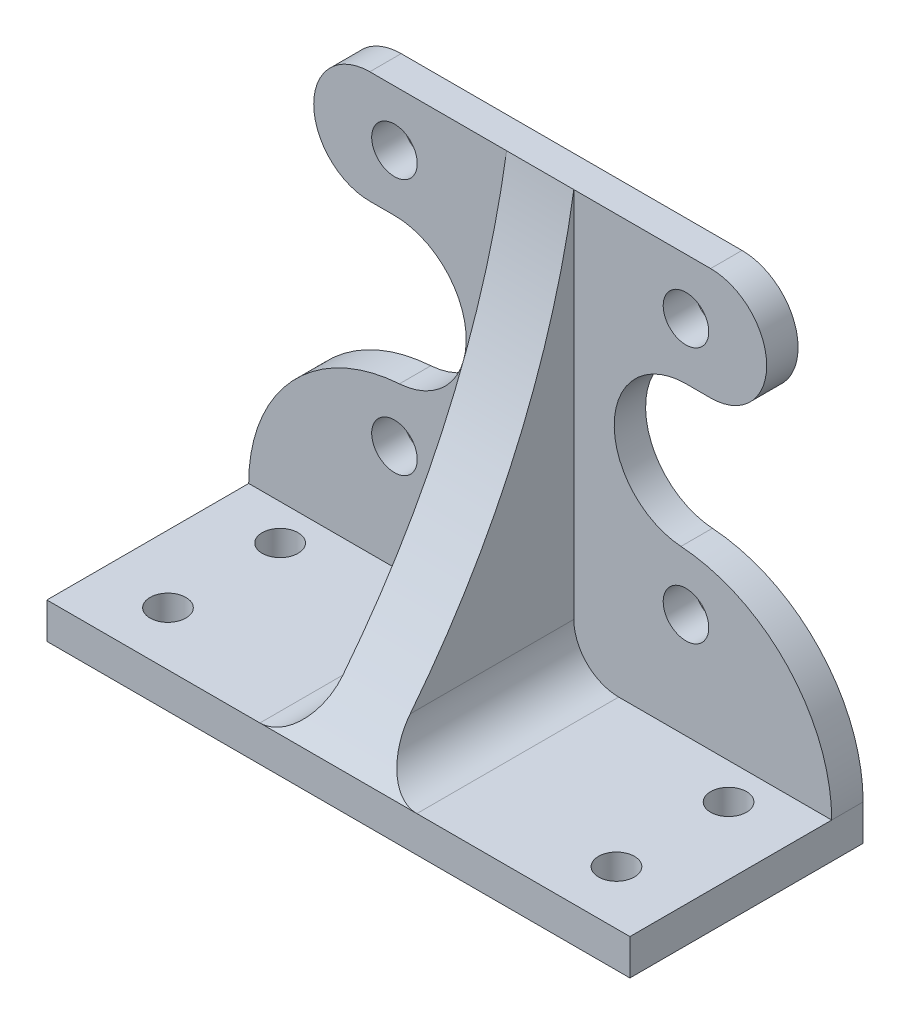
ISO-10303-21;
HEADER;
FILE_DESCRIPTION(('STEP AP214'),'2;1');
FILE_NAME('part.step','',(''),(''),'','','');
FILE_SCHEMA(('AUTOMOTIVE_DESIGN { 1 0 10303 214 1 1 1 1 }'));
ENDSEC;
DATA;
#1=APPLICATION_CONTEXT('core data for automotive mechanical design processes');
#2=APPLICATION_PROTOCOL_DEFINITION('international standard','automotive_design',2000,#1);
#3=PRODUCT_CONTEXT('',#1,'mechanical');
#4=PRODUCT('Part','Part','',(#3));
#5=PRODUCT_RELATED_PRODUCT_CATEGORY('part','',(#4));
#6=PRODUCT_DEFINITION_FORMATION('','',#4);
#7=PRODUCT_DEFINITION_CONTEXT('part definition',#1,'design');
#8=PRODUCT_DEFINITION('design','',#6,#7);
#9=PRODUCT_DEFINITION_SHAPE('','',#8);
#10=(LENGTH_UNIT() NAMED_UNIT(*) SI_UNIT(.MILLI.,.METRE.));
#11=(NAMED_UNIT(*) PLANE_ANGLE_UNIT() SI_UNIT($,.RADIAN.));
#12=(NAMED_UNIT(*) SI_UNIT($,.STERADIAN.) SOLID_ANGLE_UNIT());
#13=UNCERTAINTY_MEASURE_WITH_UNIT(LENGTH_MEASURE(1.E-05),#10,'distance_accuracy_value','');
#14=(GEOMETRIC_REPRESENTATION_CONTEXT(3) GLOBAL_UNCERTAINTY_ASSIGNED_CONTEXT((#13)) GLOBAL_UNIT_ASSIGNED_CONTEXT((#10,
#11,#12)) REPRESENTATION_CONTEXT('',''));
#15=CARTESIAN_POINT('',(0.,0.,0.));
#16=DIRECTION('',(0.,0.,1.));
#17=DIRECTION('',(1.,0.,0.));
#18=AXIS2_PLACEMENT_3D('',#15,#16,#17);
#19=CARTESIAN_POINT('',(7.5,-9.5,26.));
#20=DIRECTION('',(1.,0.,0.));
#21=DIRECTION('',(0.,0.,-1.));
#22=AXIS2_PLACEMENT_3D('',#19,#20,#21);
#23=PLANE('',#22);
#24=CARTESIAN_POINT('',(7.50000000000001,69.6030068356149,184.712880793604));
#25=DIRECTION('',(1.,0.,0.));
#26=DIRECTION('',(0.,0.,-1.));
#27=AXIS2_PLACEMENT_3D('',#24,#25,#26);
#28=CIRCLE('',#27,180.);
#29=CARTESIAN_POINT('',(7.5,41.,7.));
#30=VERTEX_POINT('',#29);
#31=CARTESIAN_POINT('',(7.50000000000001,-42.,43.4869311057027));
#32=VERTEX_POINT('',#31);
#33=EDGE_CURVE('E127',#30,#32,#28,.F.);
#34=ORIENTED_EDGE('',*,*,#33,.T.);
#35=DIRECTION('',(0.,0.,1.));
#36=VECTOR('',#35,1.);
#37=CARTESIAN_POINT('',(7.5,-42.,26.));
#38=LINE('',#37,#36);
#39=CARTESIAN_POINT('',(7.5,-42.,7.));
#40=VERTEX_POINT('',#39);
#41=EDGE_CURVE('E405',#32,#40,#38,.F.);
#42=ORIENTED_EDGE('',*,*,#41,.T.);
#43=DIRECTION('',(0.,1.,0.));
#44=VECTOR('',#43,1.);
#45=CARTESIAN_POINT('',(7.5,0.,7.));
#46=LINE('',#45,#44);
#47=EDGE_CURVE('E133',#40,#30,#46,.T.);
#48=ORIENTED_EDGE('',*,*,#47,.T.);
#49=EDGE_LOOP('',(#34,#42,#48));
#50=FACE_BOUND('',#49,.T.);
#51=ADVANCED_FACE('F48',(#50),#23,.T.);
#52=CARTESIAN_POINT('',(-7.5,-9.5,26.));
#53=DIRECTION('',(1.,0.,0.));
#54=DIRECTION('',(0.,0.,-1.));
#55=AXIS2_PLACEMENT_3D('',#52,#53,#54);
#56=PLANE('',#55);
#57=DIRECTION('',(0.,1.,0.));
#58=VECTOR('',#57,1.);
#59=CARTESIAN_POINT('',(-7.5,0.,7.));
#60=LINE('',#59,#58);
#61=CARTESIAN_POINT('',(-7.5,-42.,7.));
#62=VERTEX_POINT('',#61);
#63=CARTESIAN_POINT('',(-7.5,41.,7.));
#64=VERTEX_POINT('',#63);
#65=EDGE_CURVE('E120',#62,#64,#60,.T.);
#66=ORIENTED_EDGE('',*,*,#65,.F.);
#67=DIRECTION('',(0.,0.,1.));
#68=VECTOR('',#67,1.);
#69=CARTESIAN_POINT('',(-7.5,-42.,52.));
#70=LINE('',#69,#68);
#71=CARTESIAN_POINT('',(-7.5,-42.,43.4869311057027));
#72=VERTEX_POINT('',#71);
#73=EDGE_CURVE('E110',#62,#72,#70,.T.);
#74=ORIENTED_EDGE('',*,*,#73,.T.);
#75=CARTESIAN_POINT('',(-7.5,69.6030068356149,184.712880793604));
#76=DIRECTION('',(1.,0.,0.));
#77=DIRECTION('',(0.,0.,-1.));
#78=AXIS2_PLACEMENT_3D('',#75,#76,#77);
#79=CIRCLE('',#78,180.);
#80=EDGE_CURVE('E117',#64,#72,#79,.F.);
#81=ORIENTED_EDGE('',*,*,#80,.F.);
#82=EDGE_LOOP('',(#66,#74,#81));
#83=FACE_BOUND('',#82,.T.);
#84=ADVANCED_FACE('F115',(#83),#56,.F.);
#85=CARTESIAN_POINT('',(0.,0.,7.));
#86=DIRECTION('',(0.,0.,1.));
#87=DIRECTION('',(1.,0.,0.));
#88=AXIS2_PLACEMENT_3D('',#85,#86,#87);
#89=PLANE('',#88);
#90=CARTESIAN_POINT('',(-32.5,-28.575,7.));
#91=DIRECTION('',(0.,0.,1.));
#92=DIRECTION('',(1.,0.,0.));
#93=AXIS2_PLACEMENT_3D('',#90,#91,#92);
#94=CIRCLE('',#93,5.08);
#95=CARTESIAN_POINT('',(-27.42,-28.575,7.));
#96=VERTEX_POINT('',#95);
#97=EDGE_CURVE('E539',#96,#96,#94,.T.);
#98=ORIENTED_EDGE('',*,*,#97,.F.);
#99=EDGE_LOOP('',(#98));
#100=FACE_BOUND('',#99,.T.);
#101=CARTESIAN_POINT('',(-32.5,28.575,7.));
#102=DIRECTION('',(0.,0.,1.));
#103=DIRECTION('',(1.,0.,0.));
#104=AXIS2_PLACEMENT_3D('',#101,#102,#103);
#105=CIRCLE('',#104,5.08);
#106=CARTESIAN_POINT('',(-27.42,28.575,7.));
#107=VERTEX_POINT('',#106);
#108=EDGE_CURVE('E533',#107,#107,#105,.T.);
#109=ORIENTED_EDGE('',*,*,#108,.F.);
#110=EDGE_LOOP('',(#109));
#111=FACE_BOUND('',#110,.T.);
#112=DIRECTION('',(-1.,0.,0.));
#113=VECTOR('',#112,1.);
#114=CARTESIAN_POINT('',(-65.,-52.,7.));
#115=LINE('',#114,#113);
#116=CARTESIAN_POINT('',(-17.5,-52.,7.));
#117=VERTEX_POINT('',#116);
#118=CARTESIAN_POINT('',(-65.,-52.,7.));
#119=VERTEX_POINT('',#118);
#120=EDGE_CURVE('E239',#117,#119,#115,.T.);
#121=ORIENTED_EDGE('',*,*,#120,.F.);
#122=CARTESIAN_POINT('',(-17.5,-42.,7.));
#123=DIRECTION('',(0.,0.,1.));
#124=DIRECTION('',(1.,0.,0.));
#125=AXIS2_PLACEMENT_3D('',#122,#123,#124);
#126=CIRCLE('',#125,10.);
#127=EDGE_CURVE('E266',#117,#62,#126,.T.);
#128=ORIENTED_EDGE('',*,*,#127,.T.);
#129=ORIENTED_EDGE('',*,*,#65,.T.);
#130=DIRECTION('',(1.,0.,0.));
#131=VECTOR('',#130,1.);
#132=CARTESIAN_POINT('',(0.,41.,7.));
#133=LINE('',#132,#131);
#134=CARTESIAN_POINT('',(-38.,41.,7.));
#135=VERTEX_POINT('',#134);
#136=EDGE_CURVE('E237',#135,#64,#133,.T.);
#137=ORIENTED_EDGE('',*,*,#136,.F.);
#138=CARTESIAN_POINT('',(-38.,28.5,7.));
#139=DIRECTION('',(0.,0.,1.));
#140=DIRECTION('',(1.,0.,0.));
#141=AXIS2_PLACEMENT_3D('',#138,#139,#140);
#142=CIRCLE('',#141,12.5);
#143=CARTESIAN_POINT('',(-38.,16.,7.));
#144=VERTEX_POINT('',#143);
#145=EDGE_CURVE('E216',#144,#135,#142,.F.);
#146=ORIENTED_EDGE('',*,*,#145,.F.);
#147=DIRECTION('',(-1.,0.,0.));
#148=VECTOR('',#147,1.);
#149=CARTESIAN_POINT('',(0.,16.,7.));
#150=LINE('',#149,#148);
#151=CARTESIAN_POINT('',(-32.5,16.,7.));
#152=VERTEX_POINT('',#151);
#153=EDGE_CURVE('E221',#152,#144,#150,.T.);
#154=ORIENTED_EDGE('',*,*,#153,.F.);
#155=CARTESIAN_POINT('',(-32.5,0.,7.));
#156=DIRECTION('',(0.,0.,1.));
#157=DIRECTION('',(1.,0.,0.));
#158=AXIS2_PLACEMENT_3D('',#155,#156,#157);
#159=CIRCLE('',#158,16.);
#160=CARTESIAN_POINT('',(-31.3869221260816,-15.9612360939431,7.));
#161=VERTEX_POINT('',#160);
#162=EDGE_CURVE('E224',#161,#152,#159,.T.);
#163=ORIENTED_EDGE('',*,*,#162,.F.);
#164=CARTESIAN_POINT('',(-28.8737113402062,-52.,7.));
#165=DIRECTION('',(0.,0.,1.));
#166=DIRECTION('',(1.,0.,0.));
#167=AXIS2_PLACEMENT_3D('',#164,#165,#166);
#168=CIRCLE('',#167,36.1262886597938);
#169=EDGE_CURVE('E191',#119,#161,#168,.F.);
#170=ORIENTED_EDGE('',*,*,#169,.F.);
#171=EDGE_LOOP('',(#121,#128,#129,#137,#146,#154,#163,#170));
#172=FACE_BOUND('',#171,.T.);
#173=ADVANCED_FACE('F283',(#100,#111,#172),#89,.T.);
#174=CARTESIAN_POINT('',(-65.,-52.,52.));
#175=DIRECTION('',(0.,-1.,0.));
#176=DIRECTION('',(0.,0.,-1.));
#177=AXIS2_PLACEMENT_3D('',#174,#175,#176);
#178=PLANE('',#177);
#179=CARTESIAN_POINT('',(-50.,-52.,15.));
#180=DIRECTION('',(0.,1.,0.));
#181=DIRECTION('',(-1.,0.,0.));
#182=AXIS2_PLACEMENT_3D('',#179,#180,#181);
#183=CIRCLE('',#182,4.00000000000001);
#184=CARTESIAN_POINT('',(-54.,-52.,15.));
#185=VERTEX_POINT('',#184);
#186=EDGE_CURVE('E152',#185,#185,#183,.T.);
#187=ORIENTED_EDGE('',*,*,#186,.F.);
#188=EDGE_LOOP('',(#187));
#189=FACE_BOUND('',#188,.T.);
#190=CARTESIAN_POINT('',(-50.,-52.,40.));
#191=DIRECTION('',(0.,1.,0.));
#192=DIRECTION('',(-1.,0.,0.));
#193=AXIS2_PLACEMENT_3D('',#190,#191,#192);
#194=CIRCLE('',#193,4.00000000000001);
#195=CARTESIAN_POINT('',(-54.,-52.,40.));
#196=VERTEX_POINT('',#195);
#197=EDGE_CURVE('E146',#196,#196,#194,.T.);
#198=ORIENTED_EDGE('',*,*,#197,.F.);
#199=EDGE_LOOP('',(#198));
#200=FACE_BOUND('',#199,.T.);
#201=DIRECTION('',(-1.,0.,0.));
#202=VECTOR('',#201,1.);
#203=CARTESIAN_POINT('',(-65.,-52.,52.));
#204=LINE('',#203,#202);
#205=CARTESIAN_POINT('',(-17.5,-52.,52.));
#206=VERTEX_POINT('',#205);
#207=CARTESIAN_POINT('',(-65.,-52.,52.));
#208=VERTEX_POINT('',#207);
#209=EDGE_CURVE('E250',#206,#208,#204,.T.);
#210=ORIENTED_EDGE('',*,*,#209,.F.);
#211=DIRECTION('',(0.,0.,1.));
#212=VECTOR('',#211,1.);
#213=CARTESIAN_POINT('',(-17.5,-52.,7.));
#214=LINE('',#213,#212);
#215=EDGE_CURVE('E76',#206,#117,#214,.F.);
#216=ORIENTED_EDGE('',*,*,#215,.T.);
#217=ORIENTED_EDGE('',*,*,#120,.T.);
#218=DIRECTION('',(0.,0.,-1.));
#219=VECTOR('',#218,1.);
#220=CARTESIAN_POINT('',(-65.,-52.,52.));
#221=LINE('',#220,#219);
#222=EDGE_CURVE('E253',#208,#119,#221,.T.);
#223=ORIENTED_EDGE('',*,*,#222,.F.);
#224=EDGE_LOOP('',(#210,#216,#217,#223));
#225=FACE_BOUND('',#224,.T.);
#226=ADVANCED_FACE('F343',(#189,#200,#225),#178,.F.);
#227=CARTESIAN_POINT('',(65.,60.,7.));
#228=DIRECTION('',(-1.,0.,0.));
#229=DIRECTION('',(0.,-1.,0.));
#230=AXIS2_PLACEMENT_3D('',#227,#228,#229);
#231=PLANE('',#230);
#232=DIRECTION('',(0.,0.,-1.));
#233=VECTOR('',#232,1.);
#234=CARTESIAN_POINT('',(65.,-52.,10.));
#235=LINE('',#234,#233);
#236=CARTESIAN_POINT('',(65.,-52.,7.));
#237=VERTEX_POINT('',#236);
#238=CARTESIAN_POINT('',(65.,-52.,0.));
#239=VERTEX_POINT('',#238);
#240=EDGE_CURVE('E201',#237,#239,#235,.T.);
#241=ORIENTED_EDGE('',*,*,#240,.F.);
#242=DIRECTION('',(0.,0.,-1.));
#243=VECTOR('',#242,1.);
#244=CARTESIAN_POINT('',(65.,-52.,52.));
#245=LINE('',#244,#243);
#246=CARTESIAN_POINT('',(65.,-52.,52.));
#247=VERTEX_POINT('',#246);
#248=EDGE_CURVE('E387',#247,#237,#245,.T.);
#249=ORIENTED_EDGE('',*,*,#248,.F.);
#250=DIRECTION('',(0.,1.,0.));
#251=VECTOR('',#250,1.);
#252=CARTESIAN_POINT('',(65.,-60.,52.));
#253=LINE('',#252,#251);
#254=CARTESIAN_POINT('',(65.,-60.,52.));
#255=VERTEX_POINT('',#254);
#256=EDGE_CURVE('E247',#255,#247,#253,.T.);
#257=ORIENTED_EDGE('',*,*,#256,.F.);
#258=DIRECTION('',(0.,0.,-1.));
#259=VECTOR('',#258,1.);
#260=CARTESIAN_POINT('',(65.,-60.,7.));
#261=LINE('',#260,#259);
#262=CARTESIAN_POINT('',(65.,-60.,0.));
#263=VERTEX_POINT('',#262);
#264=EDGE_CURVE('E410',#255,#263,#261,.T.);
#265=ORIENTED_EDGE('',*,*,#264,.T.);
#266=DIRECTION('',(0.,1.,0.));
#267=VECTOR('',#266,1.);
#268=CARTESIAN_POINT('',(65.,60.,0.));
#269=LINE('',#268,#267);
#270=EDGE_CURVE('E392',#263,#239,#269,.T.);
#271=ORIENTED_EDGE('',*,*,#270,.T.);
#272=EDGE_LOOP('',(#241,#249,#257,#265,#271));
#273=FACE_BOUND('',#272,.T.);
#274=ADVANCED_FACE('F372',(#273),#231,.F.);
#275=CARTESIAN_POINT('',(-65.,60.,7.));
#276=DIRECTION('',(1.,0.,0.));
#277=DIRECTION('',(0.,1.,0.));
#278=AXIS2_PLACEMENT_3D('',#275,#276,#277);
#279=PLANE('',#278);
#280=DIRECTION('',(0.,0.,-1.));
#281=VECTOR('',#280,1.);
#282=CARTESIAN_POINT('',(-65.,-52.,10.));
#283=LINE('',#282,#281);
#284=CARTESIAN_POINT('',(-65.,-52.,0.));
#285=VERTEX_POINT('',#284);
#286=EDGE_CURVE('E210',#119,#285,#283,.T.);
#287=ORIENTED_EDGE('',*,*,#286,.T.);
#288=DIRECTION('',(0.,-1.,0.));
#289=VECTOR('',#288,1.);
#290=CARTESIAN_POINT('',(-65.,60.,0.));
#291=LINE('',#290,#289);
#292=CARTESIAN_POINT('',(-65.,-60.,0.));
#293=VERTEX_POINT('',#292);
#294=EDGE_CURVE('E456',#285,#293,#291,.T.);
#295=ORIENTED_EDGE('',*,*,#294,.T.);
#296=DIRECTION('',(0.,0.,-1.));
#297=VECTOR('',#296,1.);
#298=CARTESIAN_POINT('',(-65.,-60.,7.));
#299=LINE('',#298,#297);
#300=CARTESIAN_POINT('',(-65.,-60.,52.));
#301=VERTEX_POINT('',#300);
#302=EDGE_CURVE('E406',#301,#293,#299,.T.);
#303=ORIENTED_EDGE('',*,*,#302,.F.);
#304=DIRECTION('',(0.,-1.,0.));
#305=VECTOR('',#304,1.);
#306=CARTESIAN_POINT('',(-65.,-60.,52.));
#307=LINE('',#306,#305);
#308=EDGE_CURVE('E240',#208,#301,#307,.T.);
#309=ORIENTED_EDGE('',*,*,#308,.F.);
#310=ORIENTED_EDGE('',*,*,#222,.T.);
#311=EDGE_LOOP('',(#287,#295,#303,#309,#310));
#312=FACE_BOUND('',#311,.T.);
#313=ADVANCED_FACE('F364',(#312),#279,.F.);
#314=ORIENTED_EDGE('',*,*,#47,.F.);
#315=CARTESIAN_POINT('',(17.5,-42.,7.));
#316=DIRECTION('',(0.,0.,1.));
#317=DIRECTION('',(1.,0.,0.));
#318=AXIS2_PLACEMENT_3D('',#315,#316,#317);
#319=CIRCLE('',#318,10.);
#320=CARTESIAN_POINT('',(17.5,-52.,7.));
#321=VERTEX_POINT('',#320);
#322=EDGE_CURVE('E98',#40,#321,#319,.T.);
#323=ORIENTED_EDGE('',*,*,#322,.T.);
#324=EDGE_CURVE('E244',#237,#321,#115,.T.);
#325=ORIENTED_EDGE('',*,*,#324,.F.);
#326=CARTESIAN_POINT('',(28.8737113402062,-52.,7.));
#327=DIRECTION('',(0.,0.,1.));
#328=DIRECTION('',(1.,0.,0.));
#329=AXIS2_PLACEMENT_3D('',#326,#327,#328);
#330=CIRCLE('',#329,36.1262886597938);
#331=CARTESIAN_POINT('',(31.3869221260816,-15.9612360939431,7.));
#332=VERTEX_POINT('',#331);
#333=EDGE_CURVE('E213',#237,#332,#330,.T.);
#334=ORIENTED_EDGE('',*,*,#333,.T.);
#335=CARTESIAN_POINT('',(32.5,0.,7.));
#336=DIRECTION('',(0.,0.,1.));
#337=DIRECTION('',(1.,0.,0.));
#338=AXIS2_PLACEMENT_3D('',#335,#336,#337);
#339=CIRCLE('',#338,16.);
#340=CARTESIAN_POINT('',(32.5,16.,7.));
#341=VERTEX_POINT('',#340);
#342=EDGE_CURVE('E227',#332,#341,#339,.F.);
#343=ORIENTED_EDGE('',*,*,#342,.T.);
#344=DIRECTION('',(1.,0.,0.));
#345=VECTOR('',#344,1.);
#346=CARTESIAN_POINT('',(0.,16.,7.));
#347=LINE('',#346,#345);
#348=CARTESIAN_POINT('',(38.,16.,7.));
#349=VERTEX_POINT('',#348);
#350=EDGE_CURVE('E230',#341,#349,#347,.T.);
#351=ORIENTED_EDGE('',*,*,#350,.T.);
#352=CARTESIAN_POINT('',(38.,28.5,7.));
#353=DIRECTION('',(0.,0.,1.));
#354=DIRECTION('',(1.,0.,0.));
#355=AXIS2_PLACEMENT_3D('',#352,#353,#354);
#356=CIRCLE('',#355,12.5);
#357=CARTESIAN_POINT('',(38.,41.,7.));
#358=VERTEX_POINT('',#357);
#359=EDGE_CURVE('E233',#349,#358,#356,.T.);
#360=ORIENTED_EDGE('',*,*,#359,.T.);
#361=EDGE_CURVE('E236',#30,#358,#133,.T.);
#362=ORIENTED_EDGE('',*,*,#361,.F.);
#363=EDGE_LOOP('',(#314,#323,#325,#334,#343,#351,#360,#362));
#364=FACE_BOUND('',#363,.T.);
#365=CARTESIAN_POINT('',(32.5,-28.575,7.));
#366=DIRECTION('',(0.,0.,1.));
#367=DIRECTION('',(-1.,0.,0.));
#368=AXIS2_PLACEMENT_3D('',#365,#366,#367);
#369=CIRCLE('',#368,5.08000000000001);
#370=CARTESIAN_POINT('',(27.42,-28.575,7.));
#371=VERTEX_POINT('',#370);
#372=EDGE_CURVE('E545',#371,#371,#369,.T.);
#373=ORIENTED_EDGE('',*,*,#372,.F.);
#374=EDGE_LOOP('',(#373));
#375=FACE_BOUND('',#374,.T.);
#376=CARTESIAN_POINT('',(32.5,28.575,7.));
#377=DIRECTION('',(0.,0.,1.));
#378=DIRECTION('',(-1.,0.,0.));
#379=AXIS2_PLACEMENT_3D('',#376,#377,#378);
#380=CIRCLE('',#379,5.08000000000001);
#381=CARTESIAN_POINT('',(27.42,28.575,7.));
#382=VERTEX_POINT('',#381);
#383=EDGE_CURVE('E415',#382,#382,#380,.T.);
#384=ORIENTED_EDGE('',*,*,#383,.F.);
#385=EDGE_LOOP('',(#384));
#386=FACE_BOUND('',#385,.T.);
#387=ADVANCED_FACE('F360',(#364,#375,#386),#89,.T.);
#388=CARTESIAN_POINT('',(0.,0.,0.));
#389=DIRECTION('',(0.,0.,1.));
#390=DIRECTION('',(1.,0.,0.));
#391=AXIS2_PLACEMENT_3D('',#388,#389,#390);
#392=PLANE('',#391);
#393=CARTESIAN_POINT('',(32.5,-28.575,0.));
#394=DIRECTION('',(0.,0.,1.));
#395=DIRECTION('',(-1.,0.,0.));
#396=AXIS2_PLACEMENT_3D('',#393,#394,#395);
#397=CIRCLE('',#396,5.08000000000001);
#398=CARTESIAN_POINT('',(27.42,-28.575,0.));
#399=VERTEX_POINT('',#398);
#400=EDGE_CURVE('E542',#399,#399,#397,.T.);
#401=ORIENTED_EDGE('',*,*,#400,.T.);
#402=EDGE_LOOP('',(#401));
#403=FACE_BOUND('',#402,.T.);
#404=CARTESIAN_POINT('',(32.5,28.575,0.));
#405=DIRECTION('',(0.,0.,1.));
#406=DIRECTION('',(-1.,0.,0.));
#407=AXIS2_PLACEMENT_3D('',#404,#405,#406);
#408=CIRCLE('',#407,5.08000000000001);
#409=CARTESIAN_POINT('',(27.42,28.575,0.));
#410=VERTEX_POINT('',#409);
#411=EDGE_CURVE('E256',#410,#410,#408,.T.);
#412=ORIENTED_EDGE('',*,*,#411,.T.);
#413=EDGE_LOOP('',(#412));
#414=FACE_BOUND('',#413,.T.);
#415=ORIENTED_EDGE('',*,*,#270,.F.);
#416=DIRECTION('',(1.,0.,0.));
#417=VECTOR('',#416,1.);
#418=CARTESIAN_POINT('',(-65.,-60.,0.));
#419=LINE('',#418,#417);
#420=EDGE_CURVE('E459',#293,#263,#419,.T.);
#421=ORIENTED_EDGE('',*,*,#420,.F.);
#422=ORIENTED_EDGE('',*,*,#294,.F.);
#423=CARTESIAN_POINT('',(-28.8737113402062,-52.,0.));
#424=DIRECTION('',(0.,0.,-1.));
#425=DIRECTION('',(-1.,0.,0.));
#426=AXIS2_PLACEMENT_3D('',#423,#424,#425);
#427=CIRCLE('',#426,36.1262886597938);
#428=CARTESIAN_POINT('',(-31.3869221260816,-15.9612360939431,0.));
#429=VERTEX_POINT('',#428);
#430=EDGE_CURVE('E172',#429,#285,#427,.F.);
#431=ORIENTED_EDGE('',*,*,#430,.F.);
#432=CARTESIAN_POINT('',(-32.5,0.,0.));
#433=DIRECTION('',(0.,0.,-1.));
#434=DIRECTION('',(-1.,0.,0.));
#435=AXIS2_PLACEMENT_3D('',#432,#433,#434);
#436=CIRCLE('',#435,16.);
#437=CARTESIAN_POINT('',(-32.5,16.,0.));
#438=VERTEX_POINT('',#437);
#439=EDGE_CURVE('E169',#438,#429,#436,.T.);
#440=ORIENTED_EDGE('',*,*,#439,.F.);
#441=DIRECTION('',(1.,0.,0.));
#442=VECTOR('',#441,1.);
#443=CARTESIAN_POINT('',(0.,16.,0.));
#444=LINE('',#443,#442);
#445=CARTESIAN_POINT('',(-38.,16.,0.));
#446=VERTEX_POINT('',#445);
#447=EDGE_CURVE('E166',#446,#438,#444,.T.);
#448=ORIENTED_EDGE('',*,*,#447,.F.);
#449=CARTESIAN_POINT('',(-38.,28.5,0.));
#450=DIRECTION('',(0.,0.,-1.));
#451=DIRECTION('',(-1.,0.,0.));
#452=AXIS2_PLACEMENT_3D('',#449,#450,#451);
#453=CIRCLE('',#452,12.5);
#454=CARTESIAN_POINT('',(-38.,41.,0.));
#455=VERTEX_POINT('',#454);
#456=EDGE_CURVE('E163',#455,#446,#453,.F.);
#457=ORIENTED_EDGE('',*,*,#456,.F.);
#458=DIRECTION('',(-1.,0.,0.));
#459=VECTOR('',#458,1.);
#460=CARTESIAN_POINT('',(0.,41.,0.));
#461=LINE('',#460,#459);
#462=CARTESIAN_POINT('',(38.,41.,0.));
#463=VERTEX_POINT('',#462);
#464=EDGE_CURVE('E158',#463,#455,#461,.T.);
#465=ORIENTED_EDGE('',*,*,#464,.F.);
#466=CARTESIAN_POINT('',(38.,28.5,0.));
#467=DIRECTION('',(0.,0.,-1.));
#468=DIRECTION('',(-1.,0.,0.));
#469=AXIS2_PLACEMENT_3D('',#466,#467,#468);
#470=CIRCLE('',#469,12.5);
#471=CARTESIAN_POINT('',(38.,16.,0.));
#472=VERTEX_POINT('',#471);
#473=EDGE_CURVE('E184',#463,#472,#470,.T.);
#474=ORIENTED_EDGE('',*,*,#473,.T.);
#475=DIRECTION('',(-1.,0.,0.));
#476=VECTOR('',#475,1.);
#477=CARTESIAN_POINT('',(0.,16.,0.));
#478=LINE('',#477,#476);
#479=CARTESIAN_POINT('',(32.5,16.,0.));
#480=VERTEX_POINT('',#479);
#481=EDGE_CURVE('E181',#472,#480,#478,.T.);
#482=ORIENTED_EDGE('',*,*,#481,.T.);
#483=CARTESIAN_POINT('',(32.5,0.,0.));
#484=DIRECTION('',(0.,0.,-1.));
#485=DIRECTION('',(-1.,0.,0.));
#486=AXIS2_PLACEMENT_3D('',#483,#484,#485);
#487=CIRCLE('',#486,16.);
#488=CARTESIAN_POINT('',(31.3869221260816,-15.9612360939431,0.));
#489=VERTEX_POINT('',#488);
#490=EDGE_CURVE('E178',#480,#489,#487,.F.);
#491=ORIENTED_EDGE('',*,*,#490,.T.);
#492=CARTESIAN_POINT('',(28.8737113402062,-52.,0.));
#493=DIRECTION('',(0.,0.,-1.));
#494=DIRECTION('',(-1.,0.,0.));
#495=AXIS2_PLACEMENT_3D('',#492,#493,#494);
#496=CIRCLE('',#495,36.1262886597938);
#497=EDGE_CURVE('E175',#489,#239,#496,.T.);
#498=ORIENTED_EDGE('',*,*,#497,.T.);
#499=EDGE_LOOP('',(#415,#421,#422,#431,#440,#448,#457,#465,#474,#482,#491,#498));
#500=FACE_BOUND('',#499,.T.);
#501=CARTESIAN_POINT('',(-32.5,-28.575,0.));
#502=DIRECTION('',(0.,0.,1.));
#503=DIRECTION('',(1.,0.,0.));
#504=AXIS2_PLACEMENT_3D('',#501,#502,#503);
#505=CIRCLE('',#504,5.08);
#506=CARTESIAN_POINT('',(-27.42,-28.575,0.));
#507=VERTEX_POINT('',#506);
#508=EDGE_CURVE('E536',#507,#507,#505,.T.);
#509=ORIENTED_EDGE('',*,*,#508,.T.);
#510=EDGE_LOOP('',(#509));
#511=FACE_BOUND('',#510,.T.);
#512=CARTESIAN_POINT('',(-32.5,28.575,0.));
#513=DIRECTION('',(0.,0.,1.));
#514=DIRECTION('',(1.,0.,0.));
#515=AXIS2_PLACEMENT_3D('',#512,#513,#514);
#516=CIRCLE('',#515,5.08);
#517=CARTESIAN_POINT('',(-27.42,28.575,0.));
#518=VERTEX_POINT('',#517);
#519=EDGE_CURVE('E463',#518,#518,#516,.T.);
#520=ORIENTED_EDGE('',*,*,#519,.T.);
#521=EDGE_LOOP('',(#520));
#522=FACE_BOUND('',#521,.T.);
#523=ADVANCED_FACE('F363',(#403,#414,#500,#511,#522),#392,.F.);
#524=CARTESIAN_POINT('',(-65.,-60.,7.));
#525=DIRECTION('',(0.,1.,0.));
#526=DIRECTION('',(0.,0.,1.));
#527=AXIS2_PLACEMENT_3D('',#524,#525,#526);
#528=PLANE('',#527);
#529=CARTESIAN_POINT('',(50.,-60.,15.));
#530=DIRECTION('',(0.,1.,0.));
#531=DIRECTION('',(1.,0.,0.));
#532=AXIS2_PLACEMENT_3D('',#529,#530,#531);
#533=CIRCLE('',#532,4.00000000000001);
#534=CARTESIAN_POINT('',(54.,-60.,15.));
#535=VERTEX_POINT('',#534);
#536=EDGE_CURVE('E137',#535,#535,#533,.T.);
#537=ORIENTED_EDGE('',*,*,#536,.T.);
#538=EDGE_LOOP('',(#537));
#539=FACE_BOUND('',#538,.T.);
#540=CARTESIAN_POINT('',(50.,-60.,40.));
#541=DIRECTION('',(0.,1.,0.));
#542=DIRECTION('',(1.,0.,0.));
#543=AXIS2_PLACEMENT_3D('',#540,#541,#542);
#544=CIRCLE('',#543,4.00000000000001);
#545=CARTESIAN_POINT('',(54.,-60.,40.));
#546=VERTEX_POINT('',#545);
#547=EDGE_CURVE('E143',#546,#546,#544,.T.);
#548=ORIENTED_EDGE('',*,*,#547,.T.);
#549=EDGE_LOOP('',(#548));
#550=FACE_BOUND('',#549,.T.);
#551=ORIENTED_EDGE('',*,*,#264,.F.);
#552=DIRECTION('',(1.,0.,0.));
#553=VECTOR('',#552,1.);
#554=CARTESIAN_POINT('',(-65.,-60.,52.));
#555=LINE('',#554,#553);
#556=EDGE_CURVE('E243',#301,#255,#555,.T.);
#557=ORIENTED_EDGE('',*,*,#556,.F.);
#558=ORIENTED_EDGE('',*,*,#302,.T.);
#559=ORIENTED_EDGE('',*,*,#420,.T.);
#560=EDGE_LOOP('',(#551,#557,#558,#559));
#561=FACE_BOUND('',#560,.T.);
#562=CARTESIAN_POINT('',(-50.,-60.,15.));
#563=DIRECTION('',(0.,1.,0.));
#564=DIRECTION('',(-1.,0.,0.));
#565=AXIS2_PLACEMENT_3D('',#562,#563,#564);
#566=CIRCLE('',#565,4.00000000000001);
#567=CARTESIAN_POINT('',(-54.,-60.,15.));
#568=VERTEX_POINT('',#567);
#569=EDGE_CURVE('E155',#568,#568,#566,.T.);
#570=ORIENTED_EDGE('',*,*,#569,.T.);
#571=EDGE_LOOP('',(#570));
#572=FACE_BOUND('',#571,.T.);
#573=CARTESIAN_POINT('',(-50.,-60.,40.));
#574=DIRECTION('',(0.,1.,0.));
#575=DIRECTION('',(-1.,0.,0.));
#576=AXIS2_PLACEMENT_3D('',#573,#574,#575);
#577=CIRCLE('',#576,4.00000000000001);
#578=CARTESIAN_POINT('',(-54.,-60.,40.));
#579=VERTEX_POINT('',#578);
#580=EDGE_CURVE('E149',#579,#579,#577,.T.);
#581=ORIENTED_EDGE('',*,*,#580,.T.);
#582=EDGE_LOOP('',(#581));
#583=FACE_BOUND('',#582,.T.);
#584=ADVANCED_FACE('F358',(#539,#550,#561,#572,#583),#528,.F.);
#585=CARTESIAN_POINT('',(-32.5,28.575,0.));
#586=DIRECTION('',(0.,0.,1.));
#587=DIRECTION('',(1.,0.,0.));
#588=AXIS2_PLACEMENT_3D('',#585,#586,#587);
#589=CYLINDRICAL_SURFACE('',#588,5.08);
#590=ORIENTED_EDGE('',*,*,#519,.F.);
#591=EDGE_LOOP('',(#590));
#592=FACE_BOUND('',#591,.T.);
#593=ORIENTED_EDGE('',*,*,#108,.T.);
#594=EDGE_LOOP('',(#593));
#595=FACE_BOUND('',#594,.T.);
#596=ADVANCED_FACE('F354',(#592,#595),#589,.F.);
#597=CARTESIAN_POINT('',(-32.5,-28.575,0.));
#598=DIRECTION('',(0.,0.,1.));
#599=DIRECTION('',(1.,0.,0.));
#600=AXIS2_PLACEMENT_3D('',#597,#598,#599);
#601=CYLINDRICAL_SURFACE('',#600,5.08);
#602=ORIENTED_EDGE('',*,*,#508,.F.);
#603=EDGE_LOOP('',(#602));
#604=FACE_BOUND('',#603,.T.);
#605=ORIENTED_EDGE('',*,*,#97,.T.);
#606=EDGE_LOOP('',(#605));
#607=FACE_BOUND('',#606,.T.);
#608=ADVANCED_FACE('F350',(#604,#607),#601,.F.);
#609=CARTESIAN_POINT('',(32.5,-28.575,0.));
#610=DIRECTION('',(0.,0.,1.));
#611=DIRECTION('',(1.,0.,0.));
#612=AXIS2_PLACEMENT_3D('',#609,#610,#611);
#613=CYLINDRICAL_SURFACE('',#612,5.08000000000001);
#614=ORIENTED_EDGE('',*,*,#400,.F.);
#615=EDGE_LOOP('',(#614));
#616=FACE_BOUND('',#615,.T.);
#617=ORIENTED_EDGE('',*,*,#372,.T.);
#618=EDGE_LOOP('',(#617));
#619=FACE_BOUND('',#618,.T.);
#620=ADVANCED_FACE('F346',(#616,#619),#613,.F.);
#621=CARTESIAN_POINT('',(32.5,28.575,0.));
#622=DIRECTION('',(0.,0.,1.));
#623=DIRECTION('',(1.,0.,0.));
#624=AXIS2_PLACEMENT_3D('',#621,#622,#623);
#625=CYLINDRICAL_SURFACE('',#624,5.08000000000001);
#626=ORIENTED_EDGE('',*,*,#411,.F.);
#627=EDGE_LOOP('',(#626));
#628=FACE_BOUND('',#627,.T.);
#629=ORIENTED_EDGE('',*,*,#383,.T.);
#630=EDGE_LOOP('',(#629));
#631=FACE_BOUND('',#630,.T.);
#632=ADVANCED_FACE('F341',(#628,#631),#625,.F.);
#633=CARTESIAN_POINT('',(50.,-52.,15.));
#634=DIRECTION('',(0.,1.,0.));
#635=DIRECTION('',(1.,0.,0.));
#636=AXIS2_PLACEMENT_3D('',#633,#634,#635);
#637=CIRCLE('',#636,4.00000000000001);
#638=CARTESIAN_POINT('',(54.,-52.,15.));
#639=VERTEX_POINT('',#638);
#640=EDGE_CURVE('E136',#639,#639,#637,.T.);
#641=ORIENTED_EDGE('',*,*,#640,.F.);
#642=EDGE_LOOP('',(#641));
#643=FACE_BOUND('',#642,.T.);
#644=CARTESIAN_POINT('',(50.,-52.,40.));
#645=DIRECTION('',(0.,1.,0.));
#646=DIRECTION('',(1.,0.,0.));
#647=AXIS2_PLACEMENT_3D('',#644,#645,#646);
#648=CIRCLE('',#647,4.00000000000001);
#649=CARTESIAN_POINT('',(54.,-52.,40.));
#650=VERTEX_POINT('',#649);
#651=EDGE_CURVE('E140',#650,#650,#648,.T.);
#652=ORIENTED_EDGE('',*,*,#651,.F.);
#653=EDGE_LOOP('',(#652));
#654=FACE_BOUND('',#653,.T.);
#655=ORIENTED_EDGE('',*,*,#324,.T.);
#656=DIRECTION('',(0.,0.,1.));
#657=VECTOR('',#656,1.);
#658=CARTESIAN_POINT('',(17.5,-52.,52.));
#659=LINE('',#658,#657);
#660=CARTESIAN_POINT('',(17.5,-52.,52.));
#661=VERTEX_POINT('',#660);
#662=EDGE_CURVE('E402',#321,#661,#659,.T.);
#663=ORIENTED_EDGE('',*,*,#662,.T.);
#664=EDGE_CURVE('E251',#247,#661,#204,.T.);
#665=ORIENTED_EDGE('',*,*,#664,.F.);
#666=ORIENTED_EDGE('',*,*,#248,.T.);
#667=EDGE_LOOP('',(#655,#663,#665,#666));
#668=FACE_BOUND('',#667,.T.);
#669=ADVANCED_FACE('F338',(#643,#654,#668),#178,.F.);
#670=CARTESIAN_POINT('',(0.,0.,52.));
#671=DIRECTION('',(0.,0.,-1.));
#672=DIRECTION('',(-1.,0.,0.));
#673=AXIS2_PLACEMENT_3D('',#670,#671,#672);
#674=PLANE('',#673);
#675=ORIENTED_EDGE('',*,*,#664,.T.);
#676=DIRECTION('',(1.,0.,0.));
#677=VECTOR('',#676,1.);
#678=CARTESIAN_POINT('',(0.,-52.,52.));
#679=LINE('',#678,#677);
#680=EDGE_CURVE('E68',#206,#661,#679,.T.);
#681=ORIENTED_EDGE('',*,*,#680,.F.);
#682=ORIENTED_EDGE('',*,*,#209,.T.);
#683=ORIENTED_EDGE('',*,*,#308,.T.);
#684=ORIENTED_EDGE('',*,*,#556,.T.);
#685=ORIENTED_EDGE('',*,*,#256,.T.);
#686=EDGE_LOOP('',(#675,#681,#682,#683,#684,#685));
#687=FACE_BOUND('',#686,.T.);
#688=ADVANCED_FACE('F334',(#687),#674,.F.);
#689=CARTESIAN_POINT('',(0.,41.,10.));
#690=DIRECTION('',(0.,-1.,0.));
#691=DIRECTION('',(0.,0.,-1.));
#692=AXIS2_PLACEMENT_3D('',#689,#690,#691);
#693=PLANE('',#692);
#694=ORIENTED_EDGE('',*,*,#464,.T.);
#695=DIRECTION('',(0.,0.,-1.));
#696=VECTOR('',#695,1.);
#697=CARTESIAN_POINT('',(-38.,41.,10.));
#698=LINE('',#697,#696);
#699=EDGE_CURVE('E187',#135,#455,#698,.T.);
#700=ORIENTED_EDGE('',*,*,#699,.F.);
#701=ORIENTED_EDGE('',*,*,#136,.T.);
#702=EDGE_CURVE('E126',#64,#30,#133,.T.);
#703=ORIENTED_EDGE('',*,*,#702,.T.);
#704=ORIENTED_EDGE('',*,*,#361,.T.);
#705=DIRECTION('',(0.,0.,-1.));
#706=VECTOR('',#705,1.);
#707=CARTESIAN_POINT('',(38.,41.,10.));
#708=LINE('',#707,#706);
#709=EDGE_CURVE('E188',#358,#463,#708,.T.);
#710=ORIENTED_EDGE('',*,*,#709,.T.);
#711=EDGE_LOOP('',(#694,#700,#701,#703,#704,#710));
#712=FACE_BOUND('',#711,.T.);
#713=ADVANCED_FACE('F304',(#712),#693,.F.);
#714=CARTESIAN_POINT('',(38.,28.5,10.));
#715=DIRECTION('',(0.,0.,-1.));
#716=DIRECTION('',(-1.,0.,0.));
#717=AXIS2_PLACEMENT_3D('',#714,#715,#716);
#718=CYLINDRICAL_SURFACE('',#717,12.5);
#719=DIRECTION('',(0.,0.,-1.));
#720=VECTOR('',#719,1.);
#721=CARTESIAN_POINT('',(38.,16.,10.));
#722=LINE('',#721,#720);
#723=EDGE_CURVE('E192',#349,#472,#722,.T.);
#724=ORIENTED_EDGE('',*,*,#723,.T.);
#725=ORIENTED_EDGE('',*,*,#473,.F.);
#726=ORIENTED_EDGE('',*,*,#709,.F.);
#727=ORIENTED_EDGE('',*,*,#359,.F.);
#728=EDGE_LOOP('',(#724,#725,#726,#727));
#729=FACE_BOUND('',#728,.T.);
#730=ADVANCED_FACE('F300',(#729),#718,.T.);
#731=CARTESIAN_POINT('',(0.,16.,10.));
#732=DIRECTION('',(0.,-1.,0.));
#733=DIRECTION('',(0.,0.,-1.));
#734=AXIS2_PLACEMENT_3D('',#731,#732,#733);
#735=PLANE('',#734);
#736=DIRECTION('',(0.,0.,-1.));
#737=VECTOR('',#736,1.);
#738=CARTESIAN_POINT('',(32.5,16.,10.));
#739=LINE('',#738,#737);
#740=EDGE_CURVE('E195',#341,#480,#739,.T.);
#741=ORIENTED_EDGE('',*,*,#740,.T.);
#742=ORIENTED_EDGE('',*,*,#481,.F.);
#743=ORIENTED_EDGE('',*,*,#723,.F.);
#744=ORIENTED_EDGE('',*,*,#350,.F.);
#745=EDGE_LOOP('',(#741,#742,#743,#744));
#746=FACE_BOUND('',#745,.T.);
#747=ADVANCED_FACE('F303',(#746),#735,.T.);
#748=CARTESIAN_POINT('',(32.5,0.,10.));
#749=DIRECTION('',(0.,0.,-1.));
#750=DIRECTION('',(-1.,0.,0.));
#751=AXIS2_PLACEMENT_3D('',#748,#749,#750);
#752=CYLINDRICAL_SURFACE('',#751,16.);
#753=DIRECTION('',(0.,0.,-1.));
#754=VECTOR('',#753,1.);
#755=CARTESIAN_POINT('',(31.3869221260816,-15.9612360939431,10.));
#756=LINE('',#755,#754);
#757=EDGE_CURVE('E198',#332,#489,#756,.T.);
#758=ORIENTED_EDGE('',*,*,#757,.T.);
#759=ORIENTED_EDGE('',*,*,#490,.F.);
#760=ORIENTED_EDGE('',*,*,#740,.F.);
#761=ORIENTED_EDGE('',*,*,#342,.F.);
#762=EDGE_LOOP('',(#758,#759,#760,#761));
#763=FACE_BOUND('',#762,.T.);
#764=ADVANCED_FACE('F308',(#763),#752,.F.);
#765=CARTESIAN_POINT('',(28.8737113402062,-52.,10.));
#766=DIRECTION('',(0.,0.,-1.));
#767=DIRECTION('',(-1.,0.,0.));
#768=AXIS2_PLACEMENT_3D('',#765,#766,#767);
#769=CYLINDRICAL_SURFACE('',#768,36.1262886597938);
#770=ORIENTED_EDGE('',*,*,#240,.T.);
#771=ORIENTED_EDGE('',*,*,#497,.F.);
#772=ORIENTED_EDGE('',*,*,#757,.F.);
#773=ORIENTED_EDGE('',*,*,#333,.F.);
#774=EDGE_LOOP('',(#770,#771,#772,#773));
#775=FACE_BOUND('',#774,.T.);
#776=ADVANCED_FACE('F312',(#775),#769,.T.);
#777=CARTESIAN_POINT('',(-28.8737113402062,-52.,10.));
#778=DIRECTION('',(0.,0.,-1.));
#779=DIRECTION('',(-1.,0.,0.));
#780=AXIS2_PLACEMENT_3D('',#777,#778,#779);
#781=CYLINDRICAL_SURFACE('',#780,36.1262886597938);
#782=ORIENTED_EDGE('',*,*,#169,.T.);
#783=DIRECTION('',(0.,0.,-1.));
#784=VECTOR('',#783,1.);
#785=CARTESIAN_POINT('',(-31.3869221260816,-15.9612360939431,10.));
#786=LINE('',#785,#784);
#787=EDGE_CURVE('E434',#161,#429,#786,.T.);
#788=ORIENTED_EDGE('',*,*,#787,.T.);
#789=ORIENTED_EDGE('',*,*,#430,.T.);
#790=ORIENTED_EDGE('',*,*,#286,.F.);
#791=EDGE_LOOP('',(#782,#788,#789,#790));
#792=FACE_BOUND('',#791,.T.);
#793=ADVANCED_FACE('F316',(#792),#781,.T.);
#794=CARTESIAN_POINT('',(-32.5,0.,10.));
#795=DIRECTION('',(0.,0.,-1.));
#796=DIRECTION('',(-1.,0.,0.));
#797=AXIS2_PLACEMENT_3D('',#794,#795,#796);
#798=CYLINDRICAL_SURFACE('',#797,16.);
#799=ORIENTED_EDGE('',*,*,#162,.T.);
#800=DIRECTION('',(0.,0.,-1.));
#801=VECTOR('',#800,1.);
#802=CARTESIAN_POINT('',(-32.5,16.,10.));
#803=LINE('',#802,#801);
#804=EDGE_CURVE('E445',#152,#438,#803,.T.);
#805=ORIENTED_EDGE('',*,*,#804,.T.);
#806=ORIENTED_EDGE('',*,*,#439,.T.);
#807=ORIENTED_EDGE('',*,*,#787,.F.);
#808=EDGE_LOOP('',(#799,#805,#806,#807));
#809=FACE_BOUND('',#808,.T.);
#810=ADVANCED_FACE('F320',(#809),#798,.F.);
#811=CARTESIAN_POINT('',(0.,16.,10.));
#812=DIRECTION('',(0.,1.,0.));
#813=DIRECTION('',(0.,0.,1.));
#814=AXIS2_PLACEMENT_3D('',#811,#812,#813);
#815=PLANE('',#814);
#816=ORIENTED_EDGE('',*,*,#153,.T.);
#817=DIRECTION('',(0.,0.,-1.));
#818=VECTOR('',#817,1.);
#819=CARTESIAN_POINT('',(-38.,16.,10.));
#820=LINE('',#819,#818);
#821=EDGE_CURVE('E442',#144,#446,#820,.T.);
#822=ORIENTED_EDGE('',*,*,#821,.T.);
#823=ORIENTED_EDGE('',*,*,#447,.T.);
#824=ORIENTED_EDGE('',*,*,#804,.F.);
#825=EDGE_LOOP('',(#816,#822,#823,#824));
#826=FACE_BOUND('',#825,.T.);
#827=ADVANCED_FACE('F324',(#826),#815,.F.);
#828=CARTESIAN_POINT('',(-38.,28.5,10.));
#829=DIRECTION('',(0.,0.,-1.));
#830=DIRECTION('',(-1.,0.,0.));
#831=AXIS2_PLACEMENT_3D('',#828,#829,#830);
#832=CYLINDRICAL_SURFACE('',#831,12.5);
#833=ORIENTED_EDGE('',*,*,#145,.T.);
#834=ORIENTED_EDGE('',*,*,#699,.T.);
#835=ORIENTED_EDGE('',*,*,#456,.T.);
#836=ORIENTED_EDGE('',*,*,#821,.F.);
#837=EDGE_LOOP('',(#833,#834,#835,#836));
#838=FACE_BOUND('',#837,.T.);
#839=ADVANCED_FACE('F298',(#838),#832,.T.);
#840=CARTESIAN_POINT('',(-50.,-60.,15.));
#841=DIRECTION('',(0.,1.,0.));
#842=DIRECTION('',(-1.,0.,0.));
#843=AXIS2_PLACEMENT_3D('',#840,#841,#842);
#844=CYLINDRICAL_SURFACE('',#843,4.00000000000001);
#845=ORIENTED_EDGE('',*,*,#569,.F.);
#846=EDGE_LOOP('',(#845));
#847=FACE_BOUND('',#846,.T.);
#848=ORIENTED_EDGE('',*,*,#186,.T.);
#849=EDGE_LOOP('',(#848));
#850=FACE_BOUND('',#849,.T.);
#851=ADVANCED_FACE('F294',(#847,#850),#844,.F.);
#852=CARTESIAN_POINT('',(-50.,-60.,40.));
#853=DIRECTION('',(0.,1.,0.));
#854=DIRECTION('',(-1.,0.,0.));
#855=AXIS2_PLACEMENT_3D('',#852,#853,#854);
#856=CYLINDRICAL_SURFACE('',#855,4.00000000000001);
#857=ORIENTED_EDGE('',*,*,#580,.F.);
#858=EDGE_LOOP('',(#857));
#859=FACE_BOUND('',#858,.T.);
#860=ORIENTED_EDGE('',*,*,#197,.T.);
#861=EDGE_LOOP('',(#860));
#862=FACE_BOUND('',#861,.T.);
#863=ADVANCED_FACE('F290',(#859,#862),#856,.F.);
#864=CARTESIAN_POINT('',(50.,-60.,40.));
#865=DIRECTION('',(0.,1.,0.));
#866=DIRECTION('',(-1.,0.,0.));
#867=AXIS2_PLACEMENT_3D('',#864,#865,#866);
#868=CYLINDRICAL_SURFACE('',#867,4.00000000000001);
#869=ORIENTED_EDGE('',*,*,#547,.F.);
#870=EDGE_LOOP('',(#869));
#871=FACE_BOUND('',#870,.T.);
#872=ORIENTED_EDGE('',*,*,#651,.T.);
#873=EDGE_LOOP('',(#872));
#874=FACE_BOUND('',#873,.T.);
#875=ADVANCED_FACE('F286',(#871,#874),#868,.F.);
#876=CARTESIAN_POINT('',(50.,-60.,15.));
#877=DIRECTION('',(0.,1.,0.));
#878=DIRECTION('',(-1.,0.,0.));
#879=AXIS2_PLACEMENT_3D('',#876,#877,#878);
#880=CYLINDRICAL_SURFACE('',#879,4.00000000000001);
#881=ORIENTED_EDGE('',*,*,#536,.F.);
#882=EDGE_LOOP('',(#881));
#883=FACE_BOUND('',#882,.T.);
#884=ORIENTED_EDGE('',*,*,#640,.T.);
#885=EDGE_LOOP('',(#884));
#886=FACE_BOUND('',#885,.T.);
#887=ADVANCED_FACE('F276',(#883,#886),#880,.F.);
#888=CARTESIAN_POINT('',(-65.00005,69.6030068356149,184.712880793604));
#889=DIRECTION('',(1.,0.,0.));
#890=DIRECTION('',(0.,0.,-1.));
#891=AXIS2_PLACEMENT_3D('',#888,#889,#890);
#892=CYLINDRICAL_SURFACE('',#891,180.);
#893=ORIENTED_EDGE('',*,*,#702,.F.);
#894=ORIENTED_EDGE('',*,*,#80,.T.);
#895=CARTESIAN_POINT('',(-7.5,-42.,43.4869311057027));
#896=CARTESIAN_POINT('',(-7.50003511506284,-42.3304942193025,43.7480865975722));
#897=CARTESIAN_POINT('',(-7.5163847580542,-42.6600425852607,44.0104100342784));
#898=CARTESIAN_POINT('',(-7.58141339320745,-43.3153970215409,44.535816699853));
#899=CARTESIAN_POINT('',(-7.63009673124933,-43.6412025828139,44.7989000261227));
#900=CARTESIAN_POINT('',(-7.76018376827348,-44.2905797774712,45.3269839381118));
#901=CARTESIAN_POINT('',(-7.84193132635769,-44.6140904023586,45.5919749970858));
#902=CARTESIAN_POINT('',(-8.03809661895748,-45.253333958704,46.1192569232983));
#903=CARTESIAN_POINT('',(-8.15251487988808,-45.5690667647509,46.3815477469579));
#904=CARTESIAN_POINT('',(-8.4244189780447,-46.2149764928208,46.9217870186365));
#905=CARTESIAN_POINT('',(-8.58457152797095,-46.5443542105957,47.199357408154));
#906=CARTESIAN_POINT('',(-8.94357386840572,-47.1888002994708,47.7462702403553));
#907=CARTESIAN_POINT('',(-9.14243362010862,-47.503864961347,48.0156105443612));
#908=CARTESIAN_POINT('',(-9.57859257755755,-48.1148705169798,48.5414331773993));
#909=CARTESIAN_POINT('',(-9.8157287836732,-48.4108853691876,48.7979642418359));
#910=CARTESIAN_POINT('',(-10.3296730281855,-48.9809372435484,49.2950424739879));
#911=CARTESIAN_POINT('',(-10.6064507617381,-49.2549908071673,49.5356016480242));
#912=CARTESIAN_POINT('',(-11.0814345381536,-49.6719135573715,49.9036188792005));
#913=CARTESIAN_POINT('',(-11.2668628259429,-49.823455979556,50.0378712177049));
#914=CARTESIAN_POINT('',(-11.6521618968431,-50.1154911738297,50.2974079807491));
#915=CARTESIAN_POINT('',(-11.852030490545,-50.255985614273,50.4226937590702));
#916=CARTESIAN_POINT('',(-12.2658311123267,-50.5243321405439,50.6626856103178));
#917=CARTESIAN_POINT('',(-12.4797511326477,-50.6521947928619,50.7774005202799));
#918=CARTESIAN_POINT('',(-12.9213300734436,-50.8937665087624,50.9946920342159));
#919=CARTESIAN_POINT('',(-13.1489867893179,-51.0074778345661,51.0972705781711));
#920=CARTESIAN_POINT('',(-13.5781383980279,-51.2013489689814,51.2725505075026));
#921=CARTESIAN_POINT('',(-13.7776663616756,-51.2839417480456,51.3473817167482));
#922=CARTESIAN_POINT('',(-14.1849189085525,-51.4370302867435,51.4863064939093));
#923=CARTESIAN_POINT('',(-14.3926419119911,-51.5075283640415,51.5504021189903));
#924=CARTESIAN_POINT('',(-14.814995687815,-51.6353172444962,51.6667375083569));
#925=CARTESIAN_POINT('',(-15.0296151933648,-51.6926284539983,51.7189955889719));
#926=CARTESIAN_POINT('',(-15.4646917970588,-51.7932313036394,51.8108191099715));
#927=CARTESIAN_POINT('',(-15.6851469045788,-51.8365276594842,51.8503888196858));
#928=CARTESIAN_POINT('',(-16.1689723652211,-51.9145462506781,51.9217379648166));
#929=CARTESIAN_POINT('',(-16.4331828285701,-51.9464990903842,51.9509942871138));
#930=CARTESIAN_POINT('',(-16.8318479164945,-51.9785480748757,51.9803464048468));
#931=CARTESIAN_POINT('',(-16.9652115065632,-51.9865844046911,51.987708431464));
#932=CARTESIAN_POINT('',(-17.2323734447424,-51.9973123647463,51.9975372960659));
#933=CARTESIAN_POINT('',(-17.3661719116691,-52.0000023849476,52.0000026594226));
#934=CARTESIAN_POINT('',(-17.5,-52.,52.));
#935=B_SPLINE_CURVE_WITH_KNOTS('',3,(#895,#896,#897,#898,#899,#900,#901,#902,#903,#904,#905,
#906,#907,#908,#909,#910,#911,#912,#913,#914,#915,#916,#917,#918,#919,#920,#921,#922,#923,#924,
#925,#926,#927,#928,#929,#930,#931,#932,#933,#934),.UNSPECIFIED.,.F.,.F.,(4,2,2,2,2,2,2,2,2,2,2,
2,2,2,2,2,2,2,2,4),(0.,1.26332600478343,2.52682184399349,3.80381016705639,5.08081906707985,
6.45761517280725,7.83476606288586,9.20620002368645,10.5765911026389,11.3995748695227,
12.2224341181294,13.0445991108476,13.8666325035658,14.5516035553115,15.2364432015475,
15.9202158393087,16.6037581621091,17.4052703310286,17.8065257531501,18.2079019948539),.UNSPECIFIED.);
#936=EDGE_CURVE('E13',#72,#206,#935,.T.);
#937=ORIENTED_EDGE('',*,*,#936,.T.);
#938=ORIENTED_EDGE('',*,*,#680,.T.);
#939=CARTESIAN_POINT('',(17.5,-52.,52.));
#940=CARTESIAN_POINT('',(17.3844051319912,-52.00000153842,52.0000016774328));
#941=CARTESIAN_POINT('',(17.2688278364568,-51.9979951061764,51.9981629111097));
#942=CARTESIAN_POINT('',(17.0379348941485,-51.9899868351955,51.990825605786));
#943=CARTESIAN_POINT('',(16.9226192321428,-51.9839852353655,51.9853272856231));
#944=CARTESIAN_POINT('',(16.5776102023401,-51.9600338484454,51.9633887365603));
#945=CARTESIAN_POINT('',(16.3486263827167,-51.9361373888873,51.9415048326505));
#946=CARTESIAN_POINT('',(15.8964636347438,-51.8732158008623,51.8839339575633));
#947=CARTESIAN_POINT('',(15.6732528772037,-51.8343135580382,51.8483591097945));
#948=CARTESIAN_POINT('',(15.2323241361692,-51.7420931706924,51.7641290224011));
#949=CARTESIAN_POINT('',(15.0146069005906,-51.6887730747058,51.7154720121033));
#950=CARTESIAN_POINT('',(14.5867344952324,-51.5688094746937,51.6061661423968));
#951=CARTESIAN_POINT('',(14.3765586332359,-51.5022063454917,51.5455536286688));
#952=CARTESIAN_POINT('',(13.9640893892459,-51.3565590237382,51.4132442499021));
#953=CARTESIAN_POINT('',(13.7617989540233,-51.2775102348288,51.341543289918));
#954=CARTESIAN_POINT('',(13.3656501173779,-51.1078900062581,51.1880049036783));
#955=CARTESIAN_POINT('',(13.171806829512,-51.0172989667017,51.1061502418166));
#956=CARTESIAN_POINT('',(12.7934652648469,-50.8257302514375,50.9334506673839));
#957=CARTESIAN_POINT('',(12.6089690611939,-50.7247502864289,50.842603773455));
#958=CARTESIAN_POINT('',(12.1812557588532,-50.4731212687242,50.6167889081406));
#959=CARTESIAN_POINT('',(11.9424451129308,-50.3182058001433,50.4781974534558));
#960=CARTESIAN_POINT('',(11.4839684520572,-49.9928976890575,50.1882841318143));
#961=CARTESIAN_POINT('',(11.2643033823339,-49.8225042832455,50.0369616370431));
#962=CARTESIAN_POINT('',(10.8438961604625,-49.46806408822,49.7234882135129));
#963=CARTESIAN_POINT('',(10.6431830113878,-49.2839971188056,49.5613213166556));
#964=CARTESIAN_POINT('',(10.2609727873213,-48.9042788953459,49.228243089214));
#965=CARTESIAN_POINT('',(10.0794760468393,-48.708627439736,49.057331606485));
#966=CARTESIAN_POINT('',(9.68470136452501,-48.2480616671037,48.6568477670355));
#967=CARTESIAN_POINT('',(9.47784438658445,-47.9797423944908,48.4248449565708));
#968=CARTESIAN_POINT('',(9.09542642777337,-47.4291387199788,47.9517431384674));
#969=CARTESIAN_POINT('',(8.91987516936036,-47.1468500143152,47.7106413330695));
#970=CARTESIAN_POINT('',(8.59951800058689,-46.5705768519562,47.2216397336354));
#971=CARTESIAN_POINT('',(8.454734653604,-46.2765839984323,46.9737351002026));
#972=CARTESIAN_POINT('',(8.19575019359684,-45.6792499404662,46.4734037469771));
#973=CARTESIAN_POINT('',(8.08154347106801,-45.3759104621324,46.2209778657185));
#974=CARTESIAN_POINT('',(7.9022489372912,-44.8198601792704,45.7614075255258));
#975=CARTESIAN_POINT('',(7.83195643828673,-44.5684246959204,45.5547284780205));
#976=CARTESIAN_POINT('',(7.71135063265711,-44.0615969312252,45.1404445123891));
#977=CARTESIAN_POINT('',(7.66103497634934,-43.8062051188983,44.9328397060574));
#978=CARTESIAN_POINT('',(7.58062724280473,-43.2934866786217,44.5184093352612));
#979=CARTESIAN_POINT('',(7.55044872032494,-43.036173179149,44.3115842798189));
#980=CARTESIAN_POINT('',(7.5101408717062,-42.5194336391178,43.8985768243907));
#981=CARTESIAN_POINT('',(7.5000132581771,-42.2600074200055,43.6923944808023));
#982=CARTESIAN_POINT('',(7.5,-42.,43.4869311057027));
#983=B_SPLINE_CURVE_WITH_KNOTS('',3,(#939,#940,#941,#942,#943,#944,#945,#946,#947,#948,#949,
#950,#951,#952,#953,#954,#955,#956,#957,#958,#959,#960,#961,#962,#963,#964,#965,#966,#967,#968,
#969,#970,#971,#972,#973,#974,#975,#976,#977,#978,#979,#980,#981,#982),.UNSPECIFIED.,.F.,.F.,(4,
2,2,2,2,2,2,2,2,2,2,2,2,2,2,2,2,2,2,2,2,4),(0.,0.346717889601377,0.693415047672654,
1.38612686159702,2.07328238153284,2.76053095496591,3.44572157487387,4.13116584150403,
4.81778997357678,5.50456573536195,6.45298175555153,7.40144457307233,8.35133611223222,
9.30124418391238,10.5313961320957,11.7619294594614,12.9933620971309,14.2245686644649,
15.2229128797328,16.2211396346219,17.2150531221499,18.2090514992261),.UNSPECIFIED.);
#984=EDGE_CURVE('E61',#661,#32,#983,.T.);
#985=ORIENTED_EDGE('',*,*,#984,.T.);
#986=ORIENTED_EDGE('',*,*,#33,.F.);
#987=EDGE_LOOP('',(#893,#894,#937,#938,#985,#986));
#988=FACE_BOUND('',#987,.T.);
#989=ADVANCED_FACE('F123',(#988),#892,.F.);
#990=CARTESIAN_POINT('',(17.5,-42.,52.));
#991=DIRECTION('',(0.,0.,1.));
#992=DIRECTION('',(1.,0.,0.));
#993=AXIS2_PLACEMENT_3D('',#990,#991,#992);
#994=CYLINDRICAL_SURFACE('',#993,10.);
#995=ORIENTED_EDGE('',*,*,#322,.F.);
#996=ORIENTED_EDGE('',*,*,#41,.F.);
#997=ORIENTED_EDGE('',*,*,#984,.F.);
#998=ORIENTED_EDGE('',*,*,#662,.F.);
#999=EDGE_LOOP('',(#995,#996,#997,#998));
#1000=FACE_BOUND('',#999,.T.);
#1001=ADVANCED_FACE('F270',(#1000),#994,.F.);
#1002=CARTESIAN_POINT('',(-17.5,-42.,26.));
#1003=DIRECTION('',(0.,0.,-1.));
#1004=DIRECTION('',(-1.,0.,0.));
#1005=AXIS2_PLACEMENT_3D('',#1002,#1003,#1004);
#1006=CYLINDRICAL_SURFACE('',#1005,10.);
#1007=ORIENTED_EDGE('',*,*,#127,.F.);
#1008=ORIENTED_EDGE('',*,*,#215,.F.);
#1009=ORIENTED_EDGE('',*,*,#936,.F.);
#1010=ORIENTED_EDGE('',*,*,#73,.F.);
#1011=EDGE_LOOP('',(#1007,#1008,#1009,#1010));
#1012=FACE_BOUND('',#1011,.T.);
#1013=ADVANCED_FACE('F50',(#1012),#1006,.F.);
#1014=CLOSED_SHELL('',(#51,#84,#173,#226,#274,#313,#387,#523,#584,#596,#608,#620,#632,#669,#688,
#713,#730,#747,#764,#776,#793,#810,#827,#839,#851,#863,#875,#887,#989,#1001,#1013));
#1015=MANIFOLD_SOLID_BREP('B2',#1014);
#1016=ADVANCED_BREP_SHAPE_REPRESENTATION('',(#18,#1015),#14);
#1017=SHAPE_DEFINITION_REPRESENTATION(#9,#1016);
ENDSEC;
END-ISO-10303-21;
